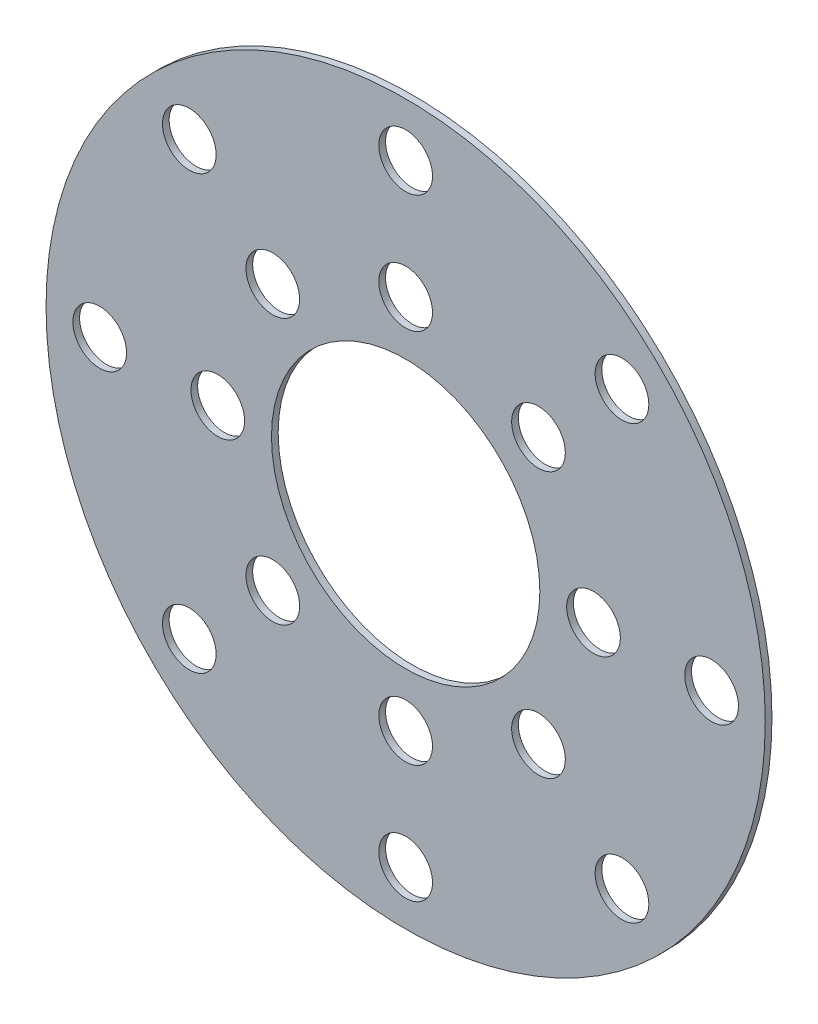
ISO-10303-21;
HEADER;
FILE_DESCRIPTION(('STEP AP214'),'2;1');
FILE_NAME('part.step','',(''),(''),'','','');
FILE_SCHEMA(('AUTOMOTIVE_DESIGN { 1 0 10303 214 1 1 1 1 }'));
ENDSEC;
DATA;
#1=APPLICATION_CONTEXT('core data for automotive mechanical design processes');
#2=APPLICATION_PROTOCOL_DEFINITION('international standard','automotive_design',2000,#1);
#3=PRODUCT_CONTEXT('',#1,'mechanical');
#4=PRODUCT('Part','Part','',(#3));
#5=PRODUCT_RELATED_PRODUCT_CATEGORY('part','',(#4));
#6=PRODUCT_DEFINITION_FORMATION('','',#4);
#7=PRODUCT_DEFINITION_CONTEXT('part definition',#1,'design');
#8=PRODUCT_DEFINITION('design','',#6,#7);
#9=PRODUCT_DEFINITION_SHAPE('','',#8);
#10=(LENGTH_UNIT() NAMED_UNIT(*) SI_UNIT(.MILLI.,.METRE.));
#11=(NAMED_UNIT(*) PLANE_ANGLE_UNIT() SI_UNIT($,.RADIAN.));
#12=(NAMED_UNIT(*) SI_UNIT($,.STERADIAN.) SOLID_ANGLE_UNIT());
#13=UNCERTAINTY_MEASURE_WITH_UNIT(LENGTH_MEASURE(1.E-05),#10,'distance_accuracy_value','');
#14=(GEOMETRIC_REPRESENTATION_CONTEXT(3) GLOBAL_UNCERTAINTY_ASSIGNED_CONTEXT((#13)) GLOBAL_UNIT_ASSIGNED_CONTEXT((#10,
#11,#12)) REPRESENTATION_CONTEXT('',''));
#15=CARTESIAN_POINT('',(0.,0.,0.));
#16=DIRECTION('',(0.,0.,1.));
#17=DIRECTION('',(1.,0.,0.));
#18=AXIS2_PLACEMENT_3D('',#15,#16,#17);
#19=CARTESIAN_POINT('',(0.,0.,0.79375));
#20=DIRECTION('',(0.,0.,-1.));
#21=DIRECTION('',(-1.,0.,0.));
#22=AXIS2_PLACEMENT_3D('',#19,#20,#21);
#23=CYLINDRICAL_SURFACE('',#22,42.545);
#24=CARTESIAN_POINT('',(0.,0.,0.79375));
#25=DIRECTION('',(0.,0.,1.));
#26=DIRECTION('',(1.,0.,0.));
#27=AXIS2_PLACEMENT_3D('',#24,#25,#26);
#28=CIRCLE('',#27,42.545);
#29=CARTESIAN_POINT('',(42.545,0.,0.79375));
#30=VERTEX_POINT('',#29);
#31=EDGE_CURVE('E10',#30,#30,#28,.T.);
#32=ORIENTED_EDGE('',*,*,#31,.F.);
#33=EDGE_LOOP('',(#32));
#34=FACE_BOUND('',#33,.T.);
#35=CARTESIAN_POINT('',(0.,0.,0.));
#36=DIRECTION('',(0.,0.,1.));
#37=DIRECTION('',(1.,0.,0.));
#38=AXIS2_PLACEMENT_3D('',#35,#36,#37);
#39=CIRCLE('',#38,42.545);
#40=CARTESIAN_POINT('',(42.545,0.,0.));
#41=VERTEX_POINT('',#40);
#42=EDGE_CURVE('E40',#41,#41,#39,.T.);
#43=ORIENTED_EDGE('',*,*,#42,.T.);
#44=EDGE_LOOP('',(#43));
#45=FACE_BOUND('',#44,.T.);
#46=ADVANCED_FACE('F37',(#34,#45),#23,.T.);
#47=CARTESIAN_POINT('',(0.,0.,0.79375));
#48=DIRECTION('',(0.,0.,1.));
#49=DIRECTION('',(1.,0.,0.));
#50=AXIS2_PLACEMENT_3D('',#47,#48,#49);
#51=PLANE('',#50);
#52=CARTESIAN_POINT('',(25.5937299450478,25.5937299450472,0.79375));
#53=DIRECTION('',(0.,0.,1.));
#54=DIRECTION('',(1.,0.,0.));
#55=AXIS2_PLACEMENT_3D('',#52,#53,#54);
#56=CIRCLE('',#55,3.17499999999934);
#57=CARTESIAN_POINT('',(28.7687299450472,25.5937299450472,0.79375));
#58=VERTEX_POINT('',#57);
#59=EDGE_CURVE('E179',#58,#58,#56,.T.);
#60=ORIENTED_EDGE('',*,*,#59,.F.);
#61=EDGE_LOOP('',(#60));
#62=FACE_BOUND('',#61,.T.);
#63=CARTESIAN_POINT('',(15.7154482118723,15.7154482118711,0.79375));
#64=DIRECTION('',(0.,0.,1.));
#65=DIRECTION('',(1.,0.,0.));
#66=AXIS2_PLACEMENT_3D('',#63,#64,#65);
#67=CIRCLE('',#66,3.1749999999987);
#68=CARTESIAN_POINT('',(18.890448211871,15.7154482118711,0.79375));
#69=VERTEX_POINT('',#68);
#70=EDGE_CURVE('E171',#69,#69,#67,.T.);
#71=ORIENTED_EDGE('',*,*,#70,.F.);
#72=EDGE_LOOP('',(#71));
#73=FACE_BOUND('',#72,.T.);
#74=CARTESIAN_POINT('',(1.12126008612575E-12,36.1950000000007,0.79375));
#75=DIRECTION('',(0.,0.,1.));
#76=DIRECTION('',(1.,0.,0.));
#77=AXIS2_PLACEMENT_3D('',#74,#75,#76);
#78=CIRCLE('',#77,3.17499999999875);
#79=CARTESIAN_POINT('',(3.17499999999987,36.1950000000007,0.79375));
#80=VERTEX_POINT('',#79);
#81=EDGE_CURVE('E163',#80,#80,#78,.T.);
#82=ORIENTED_EDGE('',*,*,#81,.F.);
#83=EDGE_LOOP('',(#82));
#84=FACE_BOUND('',#83,.T.);
#85=CARTESIAN_POINT('',(1.12382633349337E-12,22.2250000000006,0.79375));
#86=DIRECTION('',(0.,0.,1.));
#87=DIRECTION('',(1.,0.,0.));
#88=AXIS2_PLACEMENT_3D('',#85,#86,#87);
#89=CIRCLE('',#88,3.17499999999875);
#90=CARTESIAN_POINT('',(3.17499999999988,22.2250000000006,0.79375));
#91=VERTEX_POINT('',#90);
#92=EDGE_CURVE('E155',#91,#91,#89,.T.);
#93=ORIENTED_EDGE('',*,*,#92,.F.);
#94=EDGE_LOOP('',(#93));
#95=FACE_BOUND('',#94,.T.);
#96=CARTESIAN_POINT('',(-25.5937299450461,25.5937299450484,0.79375));
#97=DIRECTION('',(0.,0.,1.));
#98=DIRECTION('',(1.,0.,0.));
#99=AXIS2_PLACEMENT_3D('',#96,#97,#98);
#100=CIRCLE('',#99,3.17499999999859);
#101=CARTESIAN_POINT('',(-22.4187299450475,25.5937299450484,0.79375));
#102=VERTEX_POINT('',#101);
#103=EDGE_CURVE('E147',#102,#102,#100,.T.);
#104=ORIENTED_EDGE('',*,*,#103,.F.);
#105=EDGE_LOOP('',(#104));
#106=FACE_BOUND('',#105,.T.);
#107=CARTESIAN_POINT('',(-15.7154482118699,15.7154482118723,0.79375));
#108=DIRECTION('',(0.,0.,1.));
#109=DIRECTION('',(1.,0.,0.));
#110=AXIS2_PLACEMENT_3D('',#107,#108,#109);
#111=CIRCLE('',#110,3.1749999999986);
#112=CARTESIAN_POINT('',(-12.5404482118713,15.7154482118723,0.79375));
#113=VERTEX_POINT('',#112);
#114=EDGE_CURVE('E139',#113,#113,#111,.T.);
#115=ORIENTED_EDGE('',*,*,#114,.F.);
#116=EDGE_LOOP('',(#115));
#117=FACE_BOUND('',#116,.T.);
#118=CARTESIAN_POINT('',(-36.1949999999996,1.69725738568762E-12,0.79375));
#119=DIRECTION('',(0.,0.,1.));
#120=DIRECTION('',(1.,0.,0.));
#121=AXIS2_PLACEMENT_3D('',#118,#119,#120);
#122=CIRCLE('',#121,3.17499999999896);
#123=CARTESIAN_POINT('',(-33.0200000000006,1.69725738568762E-12,0.79375));
#124=VERTEX_POINT('',#123);
#125=EDGE_CURVE('E131',#124,#124,#122,.T.);
#126=ORIENTED_EDGE('',*,*,#125,.F.);
#127=EDGE_LOOP('',(#126));
#128=FACE_BOUND('',#127,.T.);
#129=CARTESIAN_POINT('',(-22.2249999999994,1.69896821726603E-12,0.79375));
#130=DIRECTION('',(0.,0.,1.));
#131=DIRECTION('',(1.,0.,0.));
#132=AXIS2_PLACEMENT_3D('',#129,#130,#131);
#133=CIRCLE('',#132,3.17499999999897);
#134=CARTESIAN_POINT('',(-19.0500000000005,1.69896821726603E-12,0.79375));
#135=VERTEX_POINT('',#134);
#136=EDGE_CURVE('E123',#135,#135,#133,.T.);
#137=ORIENTED_EDGE('',*,*,#136,.F.);
#138=EDGE_LOOP('',(#137));
#139=FACE_BOUND('',#138,.T.);
#140=CARTESIAN_POINT('',(-25.5937299450473,-25.5937299450455,0.79375));
#141=DIRECTION('',(0.,0.,1.));
#142=DIRECTION('',(1.,0.,0.));
#143=AXIS2_PLACEMENT_3D('',#140,#141,#142);
#144=CIRCLE('',#143,3.17499999999964);
#145=CARTESIAN_POINT('',(-22.4187299450477,-25.5937299450455,0.79375));
#146=VERTEX_POINT('',#145);
#147=EDGE_CURVE('E115',#146,#146,#144,.T.);
#148=ORIENTED_EDGE('',*,*,#147,.F.);
#149=EDGE_LOOP('',(#148));
#150=FACE_BOUND('',#149,.T.);
#151=CARTESIAN_POINT('',(-15.7154482118711,-15.7154482118694,0.79375));
#152=DIRECTION('',(0.,0.,1.));
#153=DIRECTION('',(1.,0.,0.));
#154=AXIS2_PLACEMENT_3D('',#151,#152,#153);
#155=CIRCLE('',#154,3.17499999999963);
#156=CARTESIAN_POINT('',(-12.5404482118715,-15.7154482118694,0.79375));
#157=VERTEX_POINT('',#156);
#158=EDGE_CURVE('E107',#157,#157,#155,.T.);
#159=ORIENTED_EDGE('',*,*,#158,.F.);
#160=EDGE_LOOP('',(#159));
#161=FACE_BOUND('',#160,.T.);
#162=CARTESIAN_POINT('',(-5.71564690472358E-13,-36.194999999999,0.79375));
#163=DIRECTION('',(0.,0.,1.));
#164=DIRECTION('',(1.,0.,0.));
#165=AXIS2_PLACEMENT_3D('',#162,#163,#164);
#166=CIRCLE('',#165,3.17500000000022);
#167=CARTESIAN_POINT('',(3.17499999999965,-36.194999999999,0.79375));
#168=VERTEX_POINT('',#167);
#169=EDGE_CURVE('E99',#168,#168,#166,.T.);
#170=ORIENTED_EDGE('',*,*,#169,.F.);
#171=EDGE_LOOP('',(#170));
#172=FACE_BOUND('',#171,.T.);
#173=CARTESIAN_POINT('',(-5.72420106261562E-13,-22.2249999999989,0.79375));
#174=DIRECTION('',(0.,0.,1.));
#175=DIRECTION('',(1.,0.,0.));
#176=AXIS2_PLACEMENT_3D('',#173,#174,#175);
#177=CIRCLE('',#176,3.17500000000022);
#178=CARTESIAN_POINT('',(3.17499999999965,-22.2249999999989,0.79375));
#179=VERTEX_POINT('',#178);
#180=EDGE_CURVE('E91',#179,#179,#177,.T.);
#181=ORIENTED_EDGE('',*,*,#180,.F.);
#182=EDGE_LOOP('',(#181));
#183=FACE_BOUND('',#182,.T.);
#184=CARTESIAN_POINT('',(25.5937299450462,-25.5937299450463,0.79375));
#185=DIRECTION('',(0.,0.,1.));
#186=DIRECTION('',(1.,0.,0.));
#187=AXIS2_PLACEMENT_3D('',#184,#185,#186);
#188=CIRCLE('',#187,3.1750000000007);
#189=CARTESIAN_POINT('',(28.7687299450469,-25.5937299450463,0.79375));
#190=VERTEX_POINT('',#189);
#191=EDGE_CURVE('E83',#190,#190,#188,.T.);
#192=ORIENTED_EDGE('',*,*,#191,.F.);
#193=EDGE_LOOP('',(#192));
#194=FACE_BOUND('',#193,.T.);
#195=CARTESIAN_POINT('',(15.71544821187,-15.7154482118702,0.79375));
#196=DIRECTION('',(0.,0.,1.));
#197=DIRECTION('',(1.,0.,0.));
#198=AXIS2_PLACEMENT_3D('',#195,#196,#197);
#199=CIRCLE('',#198,3.17500000000073);
#200=CARTESIAN_POINT('',(18.8904482118707,-15.7154482118702,0.79375));
#201=VERTEX_POINT('',#200);
#202=EDGE_CURVE('E75',#201,#201,#199,.T.);
#203=ORIENTED_EDGE('',*,*,#202,.F.);
#204=EDGE_LOOP('',(#203));
#205=FACE_BOUND('',#204,.T.);
#206=CARTESIAN_POINT('',(36.1950000000001,0.,0.79375));
#207=DIRECTION('',(0.,0.,1.));
#208=DIRECTION('',(1.,0.,0.));
#209=AXIS2_PLACEMENT_3D('',#206,#207,#208);
#210=CIRCLE('',#209,3.17500000000001);
#211=CARTESIAN_POINT('',(39.3700000000001,0.,0.79375));
#212=VERTEX_POINT('',#211);
#213=EDGE_CURVE('E67',#212,#212,#210,.T.);
#214=ORIENTED_EDGE('',*,*,#213,.F.);
#215=EDGE_LOOP('',(#214));
#216=FACE_BOUND('',#215,.T.);
#217=CARTESIAN_POINT('',(22.225,0.,0.79375));
#218=DIRECTION('',(0.,0.,1.));
#219=DIRECTION('',(1.,0.,0.));
#220=AXIS2_PLACEMENT_3D('',#217,#218,#219);
#221=CIRCLE('',#220,3.175);
#222=CARTESIAN_POINT('',(25.4,0.,0.79375));
#223=VERTEX_POINT('',#222);
#224=EDGE_CURVE('E59',#223,#223,#221,.T.);
#225=ORIENTED_EDGE('',*,*,#224,.F.);
#226=EDGE_LOOP('',(#225));
#227=FACE_BOUND('',#226,.T.);
#228=CARTESIAN_POINT('',(0.,0.,0.79375));
#229=DIRECTION('',(0.,0.,1.));
#230=DIRECTION('',(1.,0.,0.));
#231=AXIS2_PLACEMENT_3D('',#228,#229,#230);
#232=CIRCLE('',#231,15.875);
#233=CARTESIAN_POINT('',(15.875,0.,0.79375));
#234=VERTEX_POINT('',#233);
#235=EDGE_CURVE('E51',#234,#234,#232,.T.);
#236=ORIENTED_EDGE('',*,*,#235,.F.);
#237=EDGE_LOOP('',(#236));
#238=FACE_BOUND('',#237,.T.);
#239=ORIENTED_EDGE('',*,*,#31,.T.);
#240=EDGE_LOOP('',(#239));
#241=FACE_BOUND('',#240,.T.);
#242=ADVANCED_FACE('F197',(#62,#73,#84,#95,#106,#117,#128,#139,#150,#161,#172,#183,#194,#205,
#216,#227,#238,#241),#51,.T.);
#243=CARTESIAN_POINT('',(0.,0.,0.));
#244=DIRECTION('',(0.,0.,1.));
#245=DIRECTION('',(1.,0.,0.));
#246=AXIS2_PLACEMENT_3D('',#243,#244,#245);
#247=PLANE('',#246);
#248=CARTESIAN_POINT('',(25.5937299450478,25.5937299450472,0.));
#249=DIRECTION('',(0.,0.,1.));
#250=DIRECTION('',(1.,0.,0.));
#251=AXIS2_PLACEMENT_3D('',#248,#249,#250);
#252=CIRCLE('',#251,3.17499999999934);
#253=CARTESIAN_POINT('',(28.7687299450472,25.5937299450472,0.));
#254=VERTEX_POINT('',#253);
#255=EDGE_CURVE('E175',#254,#254,#252,.T.);
#256=ORIENTED_EDGE('',*,*,#255,.T.);
#257=EDGE_LOOP('',(#256));
#258=FACE_BOUND('',#257,.T.);
#259=CARTESIAN_POINT('',(15.7154482118723,15.7154482118711,0.));
#260=DIRECTION('',(0.,0.,1.));
#261=DIRECTION('',(1.,0.,0.));
#262=AXIS2_PLACEMENT_3D('',#259,#260,#261);
#263=CIRCLE('',#262,3.1749999999987);
#264=CARTESIAN_POINT('',(18.890448211871,15.7154482118711,0.));
#265=VERTEX_POINT('',#264);
#266=EDGE_CURVE('E167',#265,#265,#263,.T.);
#267=ORIENTED_EDGE('',*,*,#266,.T.);
#268=EDGE_LOOP('',(#267));
#269=FACE_BOUND('',#268,.T.);
#270=CARTESIAN_POINT('',(1.12126008612575E-12,36.1950000000007,0.));
#271=DIRECTION('',(0.,0.,1.));
#272=DIRECTION('',(1.,0.,0.));
#273=AXIS2_PLACEMENT_3D('',#270,#271,#272);
#274=CIRCLE('',#273,3.17499999999875);
#275=CARTESIAN_POINT('',(3.17499999999987,36.1950000000007,0.));
#276=VERTEX_POINT('',#275);
#277=EDGE_CURVE('E159',#276,#276,#274,.T.);
#278=ORIENTED_EDGE('',*,*,#277,.T.);
#279=EDGE_LOOP('',(#278));
#280=FACE_BOUND('',#279,.T.);
#281=CARTESIAN_POINT('',(1.12382633349337E-12,22.2250000000006,0.));
#282=DIRECTION('',(0.,0.,1.));
#283=DIRECTION('',(1.,0.,0.));
#284=AXIS2_PLACEMENT_3D('',#281,#282,#283);
#285=CIRCLE('',#284,3.17499999999875);
#286=CARTESIAN_POINT('',(3.17499999999988,22.2250000000006,0.));
#287=VERTEX_POINT('',#286);
#288=EDGE_CURVE('E151',#287,#287,#285,.T.);
#289=ORIENTED_EDGE('',*,*,#288,.T.);
#290=EDGE_LOOP('',(#289));
#291=FACE_BOUND('',#290,.T.);
#292=CARTESIAN_POINT('',(-25.5937299450461,25.5937299450484,0.));
#293=DIRECTION('',(0.,0.,1.));
#294=DIRECTION('',(1.,0.,0.));
#295=AXIS2_PLACEMENT_3D('',#292,#293,#294);
#296=CIRCLE('',#295,3.17499999999859);
#297=CARTESIAN_POINT('',(-22.4187299450475,25.5937299450484,0.));
#298=VERTEX_POINT('',#297);
#299=EDGE_CURVE('E143',#298,#298,#296,.T.);
#300=ORIENTED_EDGE('',*,*,#299,.T.);
#301=EDGE_LOOP('',(#300));
#302=FACE_BOUND('',#301,.T.);
#303=CARTESIAN_POINT('',(-15.7154482118699,15.7154482118723,0.));
#304=DIRECTION('',(0.,0.,1.));
#305=DIRECTION('',(1.,0.,0.));
#306=AXIS2_PLACEMENT_3D('',#303,#304,#305);
#307=CIRCLE('',#306,3.1749999999986);
#308=CARTESIAN_POINT('',(-12.5404482118713,15.7154482118723,0.));
#309=VERTEX_POINT('',#308);
#310=EDGE_CURVE('E135',#309,#309,#307,.T.);
#311=ORIENTED_EDGE('',*,*,#310,.T.);
#312=EDGE_LOOP('',(#311));
#313=FACE_BOUND('',#312,.T.);
#314=CARTESIAN_POINT('',(-36.1949999999996,1.69725738568762E-12,0.));
#315=DIRECTION('',(0.,0.,1.));
#316=DIRECTION('',(1.,0.,0.));
#317=AXIS2_PLACEMENT_3D('',#314,#315,#316);
#318=CIRCLE('',#317,3.17499999999896);
#319=CARTESIAN_POINT('',(-33.0200000000006,1.69725738568762E-12,0.));
#320=VERTEX_POINT('',#319);
#321=EDGE_CURVE('E127',#320,#320,#318,.T.);
#322=ORIENTED_EDGE('',*,*,#321,.T.);
#323=EDGE_LOOP('',(#322));
#324=FACE_BOUND('',#323,.T.);
#325=CARTESIAN_POINT('',(-22.2249999999994,1.69896821726603E-12,0.));
#326=DIRECTION('',(0.,0.,1.));
#327=DIRECTION('',(1.,0.,0.));
#328=AXIS2_PLACEMENT_3D('',#325,#326,#327);
#329=CIRCLE('',#328,3.17499999999897);
#330=CARTESIAN_POINT('',(-19.0500000000005,1.69896821726603E-12,0.));
#331=VERTEX_POINT('',#330);
#332=EDGE_CURVE('E119',#331,#331,#329,.T.);
#333=ORIENTED_EDGE('',*,*,#332,.T.);
#334=EDGE_LOOP('',(#333));
#335=FACE_BOUND('',#334,.T.);
#336=CARTESIAN_POINT('',(-25.5937299450473,-25.5937299450455,0.));
#337=DIRECTION('',(0.,0.,1.));
#338=DIRECTION('',(1.,0.,0.));
#339=AXIS2_PLACEMENT_3D('',#336,#337,#338);
#340=CIRCLE('',#339,3.17499999999964);
#341=CARTESIAN_POINT('',(-22.4187299450477,-25.5937299450455,0.));
#342=VERTEX_POINT('',#341);
#343=EDGE_CURVE('E111',#342,#342,#340,.T.);
#344=ORIENTED_EDGE('',*,*,#343,.T.);
#345=EDGE_LOOP('',(#344));
#346=FACE_BOUND('',#345,.T.);
#347=CARTESIAN_POINT('',(-15.7154482118711,-15.7154482118694,0.));
#348=DIRECTION('',(0.,0.,1.));
#349=DIRECTION('',(1.,0.,0.));
#350=AXIS2_PLACEMENT_3D('',#347,#348,#349);
#351=CIRCLE('',#350,3.17499999999963);
#352=CARTESIAN_POINT('',(-12.5404482118715,-15.7154482118694,0.));
#353=VERTEX_POINT('',#352);
#354=EDGE_CURVE('E103',#353,#353,#351,.T.);
#355=ORIENTED_EDGE('',*,*,#354,.T.);
#356=EDGE_LOOP('',(#355));
#357=FACE_BOUND('',#356,.T.);
#358=CARTESIAN_POINT('',(-5.71564690472358E-13,-36.194999999999,0.));
#359=DIRECTION('',(0.,0.,1.));
#360=DIRECTION('',(1.,0.,0.));
#361=AXIS2_PLACEMENT_3D('',#358,#359,#360);
#362=CIRCLE('',#361,3.17500000000022);
#363=CARTESIAN_POINT('',(3.17499999999965,-36.194999999999,0.));
#364=VERTEX_POINT('',#363);
#365=EDGE_CURVE('E95',#364,#364,#362,.T.);
#366=ORIENTED_EDGE('',*,*,#365,.T.);
#367=EDGE_LOOP('',(#366));
#368=FACE_BOUND('',#367,.T.);
#369=CARTESIAN_POINT('',(-5.72420106261562E-13,-22.2249999999989,0.));
#370=DIRECTION('',(0.,0.,1.));
#371=DIRECTION('',(1.,0.,0.));
#372=AXIS2_PLACEMENT_3D('',#369,#370,#371);
#373=CIRCLE('',#372,3.17500000000022);
#374=CARTESIAN_POINT('',(3.17499999999965,-22.2249999999989,0.));
#375=VERTEX_POINT('',#374);
#376=EDGE_CURVE('E87',#375,#375,#373,.T.);
#377=ORIENTED_EDGE('',*,*,#376,.T.);
#378=EDGE_LOOP('',(#377));
#379=FACE_BOUND('',#378,.T.);
#380=CARTESIAN_POINT('',(25.5937299450462,-25.5937299450463,0.));
#381=DIRECTION('',(0.,0.,1.));
#382=DIRECTION('',(1.,0.,0.));
#383=AXIS2_PLACEMENT_3D('',#380,#381,#382);
#384=CIRCLE('',#383,3.1750000000007);
#385=CARTESIAN_POINT('',(28.7687299450469,-25.5937299450463,0.));
#386=VERTEX_POINT('',#385);
#387=EDGE_CURVE('E79',#386,#386,#384,.T.);
#388=ORIENTED_EDGE('',*,*,#387,.T.);
#389=EDGE_LOOP('',(#388));
#390=FACE_BOUND('',#389,.T.);
#391=CARTESIAN_POINT('',(15.71544821187,-15.7154482118702,0.));
#392=DIRECTION('',(0.,0.,1.));
#393=DIRECTION('',(1.,0.,0.));
#394=AXIS2_PLACEMENT_3D('',#391,#392,#393);
#395=CIRCLE('',#394,3.17500000000073);
#396=CARTESIAN_POINT('',(18.8904482118707,-15.7154482118702,0.));
#397=VERTEX_POINT('',#396);
#398=EDGE_CURVE('E71',#397,#397,#395,.T.);
#399=ORIENTED_EDGE('',*,*,#398,.T.);
#400=EDGE_LOOP('',(#399));
#401=FACE_BOUND('',#400,.T.);
#402=CARTESIAN_POINT('',(36.1950000000001,0.,0.));
#403=DIRECTION('',(0.,0.,1.));
#404=DIRECTION('',(1.,0.,0.));
#405=AXIS2_PLACEMENT_3D('',#402,#403,#404);
#406=CIRCLE('',#405,3.17500000000001);
#407=CARTESIAN_POINT('',(39.3700000000001,0.,0.));
#408=VERTEX_POINT('',#407);
#409=EDGE_CURVE('E63',#408,#408,#406,.T.);
#410=ORIENTED_EDGE('',*,*,#409,.T.);
#411=EDGE_LOOP('',(#410));
#412=FACE_BOUND('',#411,.T.);
#413=CARTESIAN_POINT('',(22.225,0.,0.));
#414=DIRECTION('',(0.,0.,1.));
#415=DIRECTION('',(1.,0.,0.));
#416=AXIS2_PLACEMENT_3D('',#413,#414,#415);
#417=CIRCLE('',#416,3.175);
#418=CARTESIAN_POINT('',(25.4,0.,0.));
#419=VERTEX_POINT('',#418);
#420=EDGE_CURVE('E55',#419,#419,#417,.T.);
#421=ORIENTED_EDGE('',*,*,#420,.T.);
#422=EDGE_LOOP('',(#421));
#423=FACE_BOUND('',#422,.T.);
#424=CARTESIAN_POINT('',(0.,0.,0.));
#425=DIRECTION('',(0.,0.,1.));
#426=DIRECTION('',(1.,0.,0.));
#427=AXIS2_PLACEMENT_3D('',#424,#425,#426);
#428=CIRCLE('',#427,15.875);
#429=CARTESIAN_POINT('',(15.875,0.,0.));
#430=VERTEX_POINT('',#429);
#431=EDGE_CURVE('E49',#430,#430,#428,.T.);
#432=ORIENTED_EDGE('',*,*,#431,.T.);
#433=EDGE_LOOP('',(#432));
#434=FACE_BOUND('',#433,.T.);
#435=ORIENTED_EDGE('',*,*,#42,.F.);
#436=EDGE_LOOP('',(#435));
#437=FACE_BOUND('',#436,.T.);
#438=ADVANCED_FACE('F187',(#258,#269,#280,#291,#302,#313,#324,#335,#346,#357,#368,#379,#390,
#401,#412,#423,#434,#437),#247,.F.);
#439=CARTESIAN_POINT('',(0.,0.,0.));
#440=DIRECTION('',(0.,0.,1.));
#441=DIRECTION('',(1.,0.,0.));
#442=AXIS2_PLACEMENT_3D('',#439,#440,#441);
#443=CYLINDRICAL_SURFACE('',#442,15.875);
#444=ORIENTED_EDGE('',*,*,#431,.F.);
#445=EDGE_LOOP('',(#444));
#446=FACE_BOUND('',#445,.T.);
#447=ORIENTED_EDGE('',*,*,#235,.T.);
#448=EDGE_LOOP('',(#447));
#449=FACE_BOUND('',#448,.T.);
#450=ADVANCED_FACE('F233',(#446,#449),#443,.F.);
#451=CARTESIAN_POINT('',(22.225,0.,0.));
#452=DIRECTION('',(0.,0.,1.));
#453=DIRECTION('',(1.,0.,0.));
#454=AXIS2_PLACEMENT_3D('',#451,#452,#453);
#455=CYLINDRICAL_SURFACE('',#454,3.175);
#456=ORIENTED_EDGE('',*,*,#420,.F.);
#457=EDGE_LOOP('',(#456));
#458=FACE_BOUND('',#457,.T.);
#459=ORIENTED_EDGE('',*,*,#224,.T.);
#460=EDGE_LOOP('',(#459));
#461=FACE_BOUND('',#460,.T.);
#462=ADVANCED_FACE('F235',(#458,#461),#455,.F.);
#463=CARTESIAN_POINT('',(36.1950000000001,0.,0.));
#464=DIRECTION('',(0.,0.,1.));
#465=DIRECTION('',(1.,0.,0.));
#466=AXIS2_PLACEMENT_3D('',#463,#464,#465);
#467=CYLINDRICAL_SURFACE('',#466,3.17500000000001);
#468=ORIENTED_EDGE('',*,*,#409,.F.);
#469=EDGE_LOOP('',(#468));
#470=FACE_BOUND('',#469,.T.);
#471=ORIENTED_EDGE('',*,*,#213,.T.);
#472=EDGE_LOOP('',(#471));
#473=FACE_BOUND('',#472,.T.);
#474=ADVANCED_FACE('F242',(#470,#473),#467,.F.);
#475=CARTESIAN_POINT('',(15.71544821187,-15.7154482118702,0.));
#476=DIRECTION('',(0.,0.,1.));
#477=DIRECTION('',(1.,0.,0.));
#478=AXIS2_PLACEMENT_3D('',#475,#476,#477);
#479=CYLINDRICAL_SURFACE('',#478,3.17500000000073);
#480=ORIENTED_EDGE('',*,*,#398,.F.);
#481=EDGE_LOOP('',(#480));
#482=FACE_BOUND('',#481,.T.);
#483=ORIENTED_EDGE('',*,*,#202,.T.);
#484=EDGE_LOOP('',(#483));
#485=FACE_BOUND('',#484,.T.);
#486=ADVANCED_FACE('F277',(#482,#485),#479,.F.);
#487=CARTESIAN_POINT('',(25.5937299450462,-25.5937299450463,0.));
#488=DIRECTION('',(0.,0.,1.));
#489=DIRECTION('',(1.,0.,0.));
#490=AXIS2_PLACEMENT_3D('',#487,#488,#489);
#491=CYLINDRICAL_SURFACE('',#490,3.1750000000007);
#492=ORIENTED_EDGE('',*,*,#387,.F.);
#493=EDGE_LOOP('',(#492));
#494=FACE_BOUND('',#493,.T.);
#495=ORIENTED_EDGE('',*,*,#191,.T.);
#496=EDGE_LOOP('',(#495));
#497=FACE_BOUND('',#496,.T.);
#498=ADVANCED_FACE('F287',(#494,#497),#491,.F.);
#499=CARTESIAN_POINT('',(-5.72420106261562E-13,-22.2249999999989,0.));
#500=DIRECTION('',(0.,0.,1.));
#501=DIRECTION('',(1.,0.,0.));
#502=AXIS2_PLACEMENT_3D('',#499,#500,#501);
#503=CYLINDRICAL_SURFACE('',#502,3.17500000000022);
#504=ORIENTED_EDGE('',*,*,#376,.F.);
#505=EDGE_LOOP('',(#504));
#506=FACE_BOUND('',#505,.T.);
#507=ORIENTED_EDGE('',*,*,#180,.T.);
#508=EDGE_LOOP('',(#507));
#509=FACE_BOUND('',#508,.T.);
#510=ADVANCED_FACE('F297',(#506,#509),#503,.F.);
#511=CARTESIAN_POINT('',(-5.71564690472358E-13,-36.194999999999,0.));
#512=DIRECTION('',(0.,0.,1.));
#513=DIRECTION('',(1.,0.,0.));
#514=AXIS2_PLACEMENT_3D('',#511,#512,#513);
#515=CYLINDRICAL_SURFACE('',#514,3.17500000000022);
#516=ORIENTED_EDGE('',*,*,#365,.F.);
#517=EDGE_LOOP('',(#516));
#518=FACE_BOUND('',#517,.T.);
#519=ORIENTED_EDGE('',*,*,#169,.T.);
#520=EDGE_LOOP('',(#519));
#521=FACE_BOUND('',#520,.T.);
#522=ADVANCED_FACE('F307',(#518,#521),#515,.F.);
#523=CARTESIAN_POINT('',(-15.7154482118711,-15.7154482118694,0.));
#524=DIRECTION('',(0.,0.,1.));
#525=DIRECTION('',(1.,0.,0.));
#526=AXIS2_PLACEMENT_3D('',#523,#524,#525);
#527=CYLINDRICAL_SURFACE('',#526,3.17499999999963);
#528=ORIENTED_EDGE('',*,*,#354,.F.);
#529=EDGE_LOOP('',(#528));
#530=FACE_BOUND('',#529,.T.);
#531=ORIENTED_EDGE('',*,*,#158,.T.);
#532=EDGE_LOOP('',(#531));
#533=FACE_BOUND('',#532,.T.);
#534=ADVANCED_FACE('F317',(#530,#533),#527,.F.);
#535=CARTESIAN_POINT('',(-25.5937299450473,-25.5937299450455,0.));
#536=DIRECTION('',(0.,0.,1.));
#537=DIRECTION('',(1.,0.,0.));
#538=AXIS2_PLACEMENT_3D('',#535,#536,#537);
#539=CYLINDRICAL_SURFACE('',#538,3.17499999999964);
#540=ORIENTED_EDGE('',*,*,#343,.F.);
#541=EDGE_LOOP('',(#540));
#542=FACE_BOUND('',#541,.T.);
#543=ORIENTED_EDGE('',*,*,#147,.T.);
#544=EDGE_LOOP('',(#543));
#545=FACE_BOUND('',#544,.T.);
#546=ADVANCED_FACE('F327',(#542,#545),#539,.F.);
#547=CARTESIAN_POINT('',(-22.2249999999994,1.69896821726603E-12,0.));
#548=DIRECTION('',(0.,0.,1.));
#549=DIRECTION('',(1.,0.,0.));
#550=AXIS2_PLACEMENT_3D('',#547,#548,#549);
#551=CYLINDRICAL_SURFACE('',#550,3.17499999999897);
#552=ORIENTED_EDGE('',*,*,#332,.F.);
#553=EDGE_LOOP('',(#552));
#554=FACE_BOUND('',#553,.T.);
#555=ORIENTED_EDGE('',*,*,#136,.T.);
#556=EDGE_LOOP('',(#555));
#557=FACE_BOUND('',#556,.T.);
#558=ADVANCED_FACE('F337',(#554,#557),#551,.F.);
#559=CARTESIAN_POINT('',(-36.1949999999996,1.69725738568762E-12,0.));
#560=DIRECTION('',(0.,0.,1.));
#561=DIRECTION('',(1.,0.,0.));
#562=AXIS2_PLACEMENT_3D('',#559,#560,#561);
#563=CYLINDRICAL_SURFACE('',#562,3.17499999999896);
#564=ORIENTED_EDGE('',*,*,#321,.F.);
#565=EDGE_LOOP('',(#564));
#566=FACE_BOUND('',#565,.T.);
#567=ORIENTED_EDGE('',*,*,#125,.T.);
#568=EDGE_LOOP('',(#567));
#569=FACE_BOUND('',#568,.T.);
#570=ADVANCED_FACE('F347',(#566,#569),#563,.F.);
#571=CARTESIAN_POINT('',(-15.7154482118699,15.7154482118723,0.));
#572=DIRECTION('',(0.,0.,1.));
#573=DIRECTION('',(1.,0.,0.));
#574=AXIS2_PLACEMENT_3D('',#571,#572,#573);
#575=CYLINDRICAL_SURFACE('',#574,3.1749999999986);
#576=ORIENTED_EDGE('',*,*,#310,.F.);
#577=EDGE_LOOP('',(#576));
#578=FACE_BOUND('',#577,.T.);
#579=ORIENTED_EDGE('',*,*,#114,.T.);
#580=EDGE_LOOP('',(#579));
#581=FACE_BOUND('',#580,.T.);
#582=ADVANCED_FACE('F357',(#578,#581),#575,.F.);
#583=CARTESIAN_POINT('',(-25.5937299450461,25.5937299450484,0.));
#584=DIRECTION('',(0.,0.,1.));
#585=DIRECTION('',(1.,0.,0.));
#586=AXIS2_PLACEMENT_3D('',#583,#584,#585);
#587=CYLINDRICAL_SURFACE('',#586,3.17499999999859);
#588=ORIENTED_EDGE('',*,*,#299,.F.);
#589=EDGE_LOOP('',(#588));
#590=FACE_BOUND('',#589,.T.);
#591=ORIENTED_EDGE('',*,*,#103,.T.);
#592=EDGE_LOOP('',(#591));
#593=FACE_BOUND('',#592,.T.);
#594=ADVANCED_FACE('F367',(#590,#593),#587,.F.);
#595=CARTESIAN_POINT('',(1.12382633349337E-12,22.2250000000006,0.));
#596=DIRECTION('',(0.,0.,1.));
#597=DIRECTION('',(1.,0.,0.));
#598=AXIS2_PLACEMENT_3D('',#595,#596,#597);
#599=CYLINDRICAL_SURFACE('',#598,3.17499999999875);
#600=ORIENTED_EDGE('',*,*,#288,.F.);
#601=EDGE_LOOP('',(#600));
#602=FACE_BOUND('',#601,.T.);
#603=ORIENTED_EDGE('',*,*,#92,.T.);
#604=EDGE_LOOP('',(#603));
#605=FACE_BOUND('',#604,.T.);
#606=ADVANCED_FACE('F377',(#602,#605),#599,.F.);
#607=CARTESIAN_POINT('',(1.12126008612575E-12,36.1950000000007,0.));
#608=DIRECTION('',(0.,0.,1.));
#609=DIRECTION('',(1.,0.,0.));
#610=AXIS2_PLACEMENT_3D('',#607,#608,#609);
#611=CYLINDRICAL_SURFACE('',#610,3.17499999999875);
#612=ORIENTED_EDGE('',*,*,#277,.F.);
#613=EDGE_LOOP('',(#612));
#614=FACE_BOUND('',#613,.T.);
#615=ORIENTED_EDGE('',*,*,#81,.T.);
#616=EDGE_LOOP('',(#615));
#617=FACE_BOUND('',#616,.T.);
#618=ADVANCED_FACE('F387',(#614,#617),#611,.F.);
#619=CARTESIAN_POINT('',(15.7154482118723,15.7154482118711,0.));
#620=DIRECTION('',(0.,0.,1.));
#621=DIRECTION('',(1.,0.,0.));
#622=AXIS2_PLACEMENT_3D('',#619,#620,#621);
#623=CYLINDRICAL_SURFACE('',#622,3.1749999999987);
#624=ORIENTED_EDGE('',*,*,#266,.F.);
#625=EDGE_LOOP('',(#624));
#626=FACE_BOUND('',#625,.T.);
#627=ORIENTED_EDGE('',*,*,#70,.T.);
#628=EDGE_LOOP('',(#627));
#629=FACE_BOUND('',#628,.T.);
#630=ADVANCED_FACE('F193',(#626,#629),#623,.F.);
#631=CARTESIAN_POINT('',(25.5937299450478,25.5937299450472,0.));
#632=DIRECTION('',(0.,0.,1.));
#633=DIRECTION('',(1.,0.,0.));
#634=AXIS2_PLACEMENT_3D('',#631,#632,#633);
#635=CYLINDRICAL_SURFACE('',#634,3.17499999999934);
#636=ORIENTED_EDGE('',*,*,#255,.F.);
#637=EDGE_LOOP('',(#636));
#638=FACE_BOUND('',#637,.T.);
#639=ORIENTED_EDGE('',*,*,#59,.T.);
#640=EDGE_LOOP('',(#639));
#641=FACE_BOUND('',#640,.T.);
#642=ADVANCED_FACE('F190',(#638,#641),#635,.F.);
#643=CLOSED_SHELL('',(#46,#242,#438,#450,#462,#474,#486,#498,#510,#522,#534,#546,#558,#570,#582,
#594,#606,#618,#630,#642));
#644=MANIFOLD_SOLID_BREP('B2',#643);
#645=ADVANCED_BREP_SHAPE_REPRESENTATION('',(#18,#644),#14);
#646=SHAPE_DEFINITION_REPRESENTATION(#9,#645);
ENDSEC;
END-ISO-10303-21;
